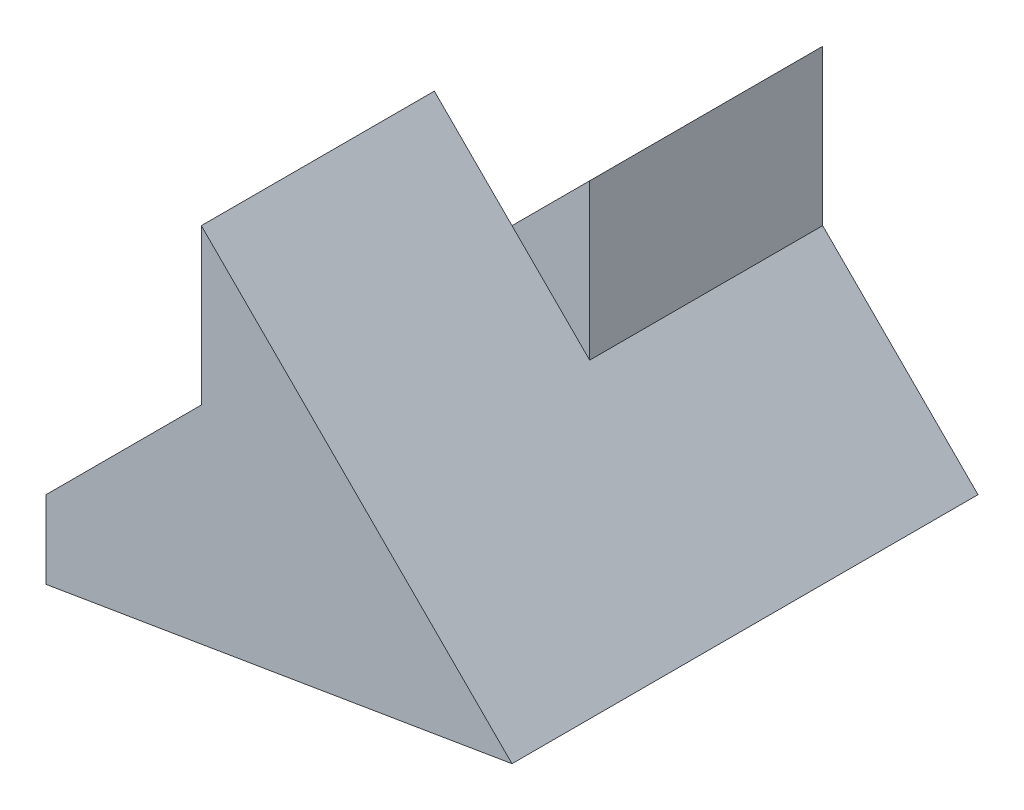
ISO-10303-21;
HEADER;
FILE_DESCRIPTION(('STEP AP214'),'2;1');
FILE_NAME('part.step','',(''),(''),'','','');
FILE_SCHEMA(('AUTOMOTIVE_DESIGN { 1 0 10303 214 1 1 1 1 }'));
ENDSEC;
DATA;
#1=APPLICATION_CONTEXT('core data for automotive mechanical design processes');
#2=APPLICATION_PROTOCOL_DEFINITION('international standard','automotive_design',2000,#1);
#3=PRODUCT_CONTEXT('',#1,'mechanical');
#4=PRODUCT('Part','Part','',(#3));
#5=PRODUCT_RELATED_PRODUCT_CATEGORY('part','',(#4));
#6=PRODUCT_DEFINITION_FORMATION('','',#4);
#7=PRODUCT_DEFINITION_CONTEXT('part definition',#1,'design');
#8=PRODUCT_DEFINITION('design','',#6,#7);
#9=PRODUCT_DEFINITION_SHAPE('','',#8);
#10=(LENGTH_UNIT() NAMED_UNIT(*) SI_UNIT(.MILLI.,.METRE.));
#11=(NAMED_UNIT(*) PLANE_ANGLE_UNIT() SI_UNIT($,.RADIAN.));
#12=(NAMED_UNIT(*) SI_UNIT($,.STERADIAN.) SOLID_ANGLE_UNIT());
#13=UNCERTAINTY_MEASURE_WITH_UNIT(LENGTH_MEASURE(1.E-05),#10,'distance_accuracy_value','');
#14=(GEOMETRIC_REPRESENTATION_CONTEXT(3) GLOBAL_UNCERTAINTY_ASSIGNED_CONTEXT((#13)) GLOBAL_UNIT_ASSIGNED_CONTEXT((#10,
#11,#12)) REPRESENTATION_CONTEXT('',''));
#15=CARTESIAN_POINT('',(0.,0.,0.));
#16=DIRECTION('',(0.,0.,1.));
#17=DIRECTION('',(1.,0.,0.));
#18=AXIS2_PLACEMENT_3D('',#15,#16,#17);
#19=CARTESIAN_POINT('',(0.,0.,0.));
#20=DIRECTION('',(0.,0.,1.));
#21=DIRECTION('',(1.,0.,0.));
#22=AXIS2_PLACEMENT_3D('',#19,#20,#21);
#23=PLANE('',#22);
#24=DIRECTION('',(0.707106781186548,0.707106781186548,0.));
#25=VECTOR('',#24,1.);
#26=CARTESIAN_POINT('',(0.,1.,0.));
#27=LINE('',#26,#25);
#28=CARTESIAN_POINT('',(2.,3.,0.));
#29=VERTEX_POINT('',#28);
#30=CARTESIAN_POINT('',(3.,4.,0.));
#31=VERTEX_POINT('',#30);
#32=EDGE_CURVE('E11',#29,#31,#27,.T.);
#33=ORIENTED_EDGE('',*,*,#32,.F.);
#34=DIRECTION('',(0.,-1.,0.));
#35=VECTOR('',#34,1.);
#36=CARTESIAN_POINT('',(2.,5.,0.));
#37=LINE('',#36,#35);
#38=CARTESIAN_POINT('',(2.,5.,0.));
#39=VERTEX_POINT('',#38);
#40=EDGE_CURVE('E131',#39,#29,#37,.T.);
#41=ORIENTED_EDGE('',*,*,#40,.F.);
#42=DIRECTION('',(-0.707106781186548,0.707106781186548,0.));
#43=VECTOR('',#42,1.);
#44=CARTESIAN_POINT('',(6.,1.,0.));
#45=LINE('',#44,#43);
#46=EDGE_CURVE('E100',#31,#39,#45,.T.);
#47=ORIENTED_EDGE('',*,*,#46,.F.);
#48=EDGE_LOOP('',(#33,#41,#47));
#49=FACE_BOUND('',#48,.T.);
#50=ADVANCED_FACE('F33',(#49),#23,.F.);
#51=CARTESIAN_POINT('',(0.,1.,3.));
#52=DIRECTION('',(1.,0.,0.));
#53=DIRECTION('',(0.,1.,0.));
#54=AXIS2_PLACEMENT_3D('',#51,#52,#53);
#55=PLANE('',#54);
#56=DIRECTION('',(0.,0.,-1.));
#57=VECTOR('',#56,1.);
#58=CARTESIAN_POINT('',(0.,1.,3.));
#59=LINE('',#58,#57);
#60=CARTESIAN_POINT('',(0.,1.,3.));
#61=VERTEX_POINT('',#60);
#62=CARTESIAN_POINT('',(0.,1.,-3.));
#63=VERTEX_POINT('',#62);
#64=EDGE_CURVE('E108',#61,#63,#59,.T.);
#65=ORIENTED_EDGE('',*,*,#64,.T.);
#66=DIRECTION('',(0.,1.,0.));
#67=VECTOR('',#66,1.);
#68=CARTESIAN_POINT('',(0.,0.,-3.));
#69=LINE('',#68,#67);
#70=CARTESIAN_POINT('',(0.,0.,-3.));
#71=VERTEX_POINT('',#70);
#72=EDGE_CURVE('E145',#71,#63,#69,.T.);
#73=ORIENTED_EDGE('',*,*,#72,.F.);
#74=DIRECTION('',(0.,0.,-1.));
#75=VECTOR('',#74,1.);
#76=CARTESIAN_POINT('',(0.,0.,3.));
#77=LINE('',#76,#75);
#78=CARTESIAN_POINT('',(0.,0.,3.));
#79=VERTEX_POINT('',#78);
#80=EDGE_CURVE('E42',#79,#71,#77,.T.);
#81=ORIENTED_EDGE('',*,*,#80,.F.);
#82=DIRECTION('',(0.,-1.,0.));
#83=VECTOR('',#82,1.);
#84=CARTESIAN_POINT('',(0.,1.,3.));
#85=LINE('',#84,#83);
#86=EDGE_CURVE('E130',#61,#79,#85,.T.);
#87=ORIENTED_EDGE('',*,*,#86,.F.);
#88=EDGE_LOOP('',(#65,#73,#81,#87));
#89=FACE_BOUND('',#88,.T.);
#90=ADVANCED_FACE('F35',(#89),#55,.F.);
#91=CARTESIAN_POINT('',(0.,0.,3.));
#92=DIRECTION('',(-0.164398987305357,0.986393923832144,0.));
#93=DIRECTION('',(-0.986393923832144,-0.164398987305357,0.));
#94=AXIS2_PLACEMENT_3D('',#91,#92,#93);
#95=PLANE('',#94);
#96=ORIENTED_EDGE('',*,*,#80,.T.);
#97=DIRECTION('',(-0.986393923832144,-0.164398987305357,0.));
#98=VECTOR('',#97,1.);
#99=CARTESIAN_POINT('',(0.,0.,-3.));
#100=LINE('',#99,#98);
#101=CARTESIAN_POINT('',(6.,1.,-3.));
#102=VERTEX_POINT('',#101);
#103=EDGE_CURVE('E150',#102,#71,#100,.T.);
#104=ORIENTED_EDGE('',*,*,#103,.F.);
#105=DIRECTION('',(0.,0.,-1.));
#106=VECTOR('',#105,1.);
#107=CARTESIAN_POINT('',(6.,1.,3.));
#108=LINE('',#107,#106);
#109=CARTESIAN_POINT('',(6.,1.,3.));
#110=VERTEX_POINT('',#109);
#111=EDGE_CURVE('E102',#110,#102,#108,.T.);
#112=ORIENTED_EDGE('',*,*,#111,.F.);
#113=DIRECTION('',(0.986393923832144,0.164398987305357,0.));
#114=VECTOR('',#113,1.);
#115=CARTESIAN_POINT('',(0.,0.,3.));
#116=LINE('',#115,#114);
#117=EDGE_CURVE('E82',#79,#110,#116,.T.);
#118=ORIENTED_EDGE('',*,*,#117,.F.);
#119=EDGE_LOOP('',(#96,#104,#112,#118));
#120=FACE_BOUND('',#119,.T.);
#121=ADVANCED_FACE('F185',(#120),#95,.F.);
#122=CARTESIAN_POINT('',(6.,1.,3.));
#123=DIRECTION('',(-0.707106781186547,-0.707106781186547,0.));
#124=DIRECTION('',(0.707106781186548,-0.707106781186548,0.));
#125=AXIS2_PLACEMENT_3D('',#122,#123,#124);
#126=PLANE('',#125);
#127=ORIENTED_EDGE('',*,*,#111,.T.);
#128=DIRECTION('',(0.707106781186548,-0.707106781186548,0.));
#129=VECTOR('',#128,1.);
#130=CARTESIAN_POINT('',(6.,1.,-3.));
#131=LINE('',#130,#129);
#132=CARTESIAN_POINT('',(4.,3.,-3.));
#133=VERTEX_POINT('',#132);
#134=EDGE_CURVE('E157',#133,#102,#131,.T.);
#135=ORIENTED_EDGE('',*,*,#134,.F.);
#136=DIRECTION('',(0.,0.,1.));
#137=VECTOR('',#136,1.);
#138=CARTESIAN_POINT('',(4.,3.,-3.));
#139=LINE('',#138,#137);
#140=CARTESIAN_POINT('',(4.,3.,0.));
#141=VERTEX_POINT('',#140);
#142=EDGE_CURVE('E143',#133,#141,#139,.T.);
#143=ORIENTED_EDGE('',*,*,#142,.T.);
#144=EDGE_CURVE('E50',#141,#31,#45,.T.);
#145=ORIENTED_EDGE('',*,*,#144,.T.);
#146=ORIENTED_EDGE('',*,*,#46,.T.);
#147=DIRECTION('',(0.,0.,-1.));
#148=VECTOR('',#147,1.);
#149=CARTESIAN_POINT('',(2.,5.,3.));
#150=LINE('',#149,#148);
#151=CARTESIAN_POINT('',(2.,5.,3.));
#152=VERTEX_POINT('',#151);
#153=EDGE_CURVE('E98',#152,#39,#150,.T.);
#154=ORIENTED_EDGE('',*,*,#153,.F.);
#155=DIRECTION('',(-0.707106781186548,0.707106781186548,0.));
#156=VECTOR('',#155,1.);
#157=CARTESIAN_POINT('',(6.,1.,3.));
#158=LINE('',#157,#156);
#159=EDGE_CURVE('E88',#110,#152,#158,.T.);
#160=ORIENTED_EDGE('',*,*,#159,.F.);
#161=EDGE_LOOP('',(#127,#135,#143,#145,#146,#154,#160));
#162=FACE_BOUND('',#161,.T.);
#163=ADVANCED_FACE('F99',(#162),#126,.F.);
#164=CARTESIAN_POINT('',(2.,5.,3.));
#165=DIRECTION('',(1.,0.,0.));
#166=DIRECTION('',(0.,1.,0.));
#167=AXIS2_PLACEMENT_3D('',#164,#165,#166);
#168=PLANE('',#167);
#169=ORIENTED_EDGE('',*,*,#40,.T.);
#170=DIRECTION('',(0.,0.,-1.));
#171=VECTOR('',#170,1.);
#172=CARTESIAN_POINT('',(2.,3.,3.));
#173=LINE('',#172,#171);
#174=CARTESIAN_POINT('',(2.,3.,3.));
#175=VERTEX_POINT('',#174);
#176=EDGE_CURVE('E103',#175,#29,#173,.T.);
#177=ORIENTED_EDGE('',*,*,#176,.F.);
#178=DIRECTION('',(0.,-1.,0.));
#179=VECTOR('',#178,1.);
#180=CARTESIAN_POINT('',(2.,5.,3.));
#181=LINE('',#180,#179);
#182=EDGE_CURVE('E92',#152,#175,#181,.T.);
#183=ORIENTED_EDGE('',*,*,#182,.F.);
#184=ORIENTED_EDGE('',*,*,#153,.T.);
#185=EDGE_LOOP('',(#169,#177,#183,#184));
#186=FACE_BOUND('',#185,.T.);
#187=ADVANCED_FACE('F105',(#186),#168,.F.);
#188=CARTESIAN_POINT('',(2.,3.,3.));
#189=DIRECTION('',(0.707106781186547,-0.707106781186547,0.));
#190=DIRECTION('',(0.707106781186548,0.707106781186548,0.));
#191=AXIS2_PLACEMENT_3D('',#188,#189,#190);
#192=PLANE('',#191);
#193=ORIENTED_EDGE('',*,*,#176,.T.);
#194=ORIENTED_EDGE('',*,*,#32,.T.);
#195=CARTESIAN_POINT('',(4.,5.,0.));
#196=VERTEX_POINT('',#195);
#197=EDGE_CURVE('E124',#31,#196,#27,.T.);
#198=ORIENTED_EDGE('',*,*,#197,.T.);
#199=DIRECTION('',(0.,0.,1.));
#200=VECTOR('',#199,1.);
#201=CARTESIAN_POINT('',(4.,5.,-3.));
#202=LINE('',#201,#200);
#203=CARTESIAN_POINT('',(4.,5.,-3.));
#204=VERTEX_POINT('',#203);
#205=EDGE_CURVE('E119',#204,#196,#202,.T.);
#206=ORIENTED_EDGE('',*,*,#205,.F.);
#207=DIRECTION('',(0.707106781186548,0.707106781186548,0.));
#208=VECTOR('',#207,1.);
#209=CARTESIAN_POINT('',(0.,1.,-3.));
#210=LINE('',#209,#208);
#211=EDGE_CURVE('E141',#63,#204,#210,.T.);
#212=ORIENTED_EDGE('',*,*,#211,.F.);
#213=ORIENTED_EDGE('',*,*,#64,.F.);
#214=DIRECTION('',(-0.707106781186548,-0.707106781186548,0.));
#215=VECTOR('',#214,1.);
#216=CARTESIAN_POINT('',(2.,3.,3.));
#217=LINE('',#216,#215);
#218=EDGE_CURVE('E59',#175,#61,#217,.T.);
#219=ORIENTED_EDGE('',*,*,#218,.F.);
#220=EDGE_LOOP('',(#193,#194,#198,#206,#212,#213,#219));
#221=FACE_BOUND('',#220,.T.);
#222=ADVANCED_FACE('F173',(#221),#192,.F.);
#223=CARTESIAN_POINT('',(0.,0.,3.));
#224=DIRECTION('',(0.,0.,1.));
#225=DIRECTION('',(1.,0.,0.));
#226=AXIS2_PLACEMENT_3D('',#223,#224,#225);
#227=PLANE('',#226);
#228=ORIENTED_EDGE('',*,*,#86,.T.);
#229=ORIENTED_EDGE('',*,*,#117,.T.);
#230=ORIENTED_EDGE('',*,*,#159,.T.);
#231=ORIENTED_EDGE('',*,*,#182,.T.);
#232=ORIENTED_EDGE('',*,*,#218,.T.);
#233=EDGE_LOOP('',(#228,#229,#230,#231,#232));
#234=FACE_BOUND('',#233,.T.);
#235=ADVANCED_FACE('F90',(#234),#227,.T.);
#236=CARTESIAN_POINT('',(0.,0.,0.));
#237=DIRECTION('',(0.,0.,1.));
#238=DIRECTION('',(1.,0.,0.));
#239=AXIS2_PLACEMENT_3D('',#236,#237,#238);
#240=PLANE('',#239);
#241=ORIENTED_EDGE('',*,*,#144,.F.);
#242=DIRECTION('',(0.,-1.,0.));
#243=VECTOR('',#242,1.);
#244=CARTESIAN_POINT('',(4.,3.,0.));
#245=LINE('',#244,#243);
#246=EDGE_CURVE('E128',#196,#141,#245,.T.);
#247=ORIENTED_EDGE('',*,*,#246,.F.);
#248=ORIENTED_EDGE('',*,*,#197,.F.);
#249=EDGE_LOOP('',(#241,#247,#248));
#250=FACE_BOUND('',#249,.T.);
#251=ADVANCED_FACE('F187',(#250),#240,.T.);
#252=CARTESIAN_POINT('',(4.,3.,-3.));
#253=DIRECTION('',(-1.,0.,0.));
#254=DIRECTION('',(0.,0.,1.));
#255=AXIS2_PLACEMENT_3D('',#252,#253,#254);
#256=PLANE('',#255);
#257=ORIENTED_EDGE('',*,*,#246,.T.);
#258=ORIENTED_EDGE('',*,*,#142,.F.);
#259=DIRECTION('',(0.,-1.,0.));
#260=VECTOR('',#259,1.);
#261=CARTESIAN_POINT('',(4.,3.,-3.));
#262=LINE('',#261,#260);
#263=EDGE_CURVE('E162',#204,#133,#262,.T.);
#264=ORIENTED_EDGE('',*,*,#263,.F.);
#265=ORIENTED_EDGE('',*,*,#205,.T.);
#266=EDGE_LOOP('',(#257,#258,#264,#265));
#267=FACE_BOUND('',#266,.T.);
#268=ADVANCED_FACE('F175',(#267),#256,.F.);
#269=CARTESIAN_POINT('',(0.,0.,-3.));
#270=DIRECTION('',(0.,0.,1.));
#271=DIRECTION('',(1.,0.,0.));
#272=AXIS2_PLACEMENT_3D('',#269,#270,#271);
#273=PLANE('',#272);
#274=ORIENTED_EDGE('',*,*,#211,.T.);
#275=ORIENTED_EDGE('',*,*,#263,.T.);
#276=ORIENTED_EDGE('',*,*,#134,.T.);
#277=ORIENTED_EDGE('',*,*,#103,.T.);
#278=ORIENTED_EDGE('',*,*,#72,.T.);
#279=EDGE_LOOP('',(#274,#275,#276,#277,#278));
#280=FACE_BOUND('',#279,.T.);
#281=ADVANCED_FACE('F167',(#280),#273,.F.);
#282=CLOSED_SHELL('',(#50,#90,#121,#163,#187,#222,#235,#251,#268,#281));
#283=MANIFOLD_SOLID_BREP('B2',#282);
#284=ADVANCED_BREP_SHAPE_REPRESENTATION('',(#18,#283),#14);
#285=SHAPE_DEFINITION_REPRESENTATION(#9,#284);
ENDSEC;
END-ISO-10303-21;
